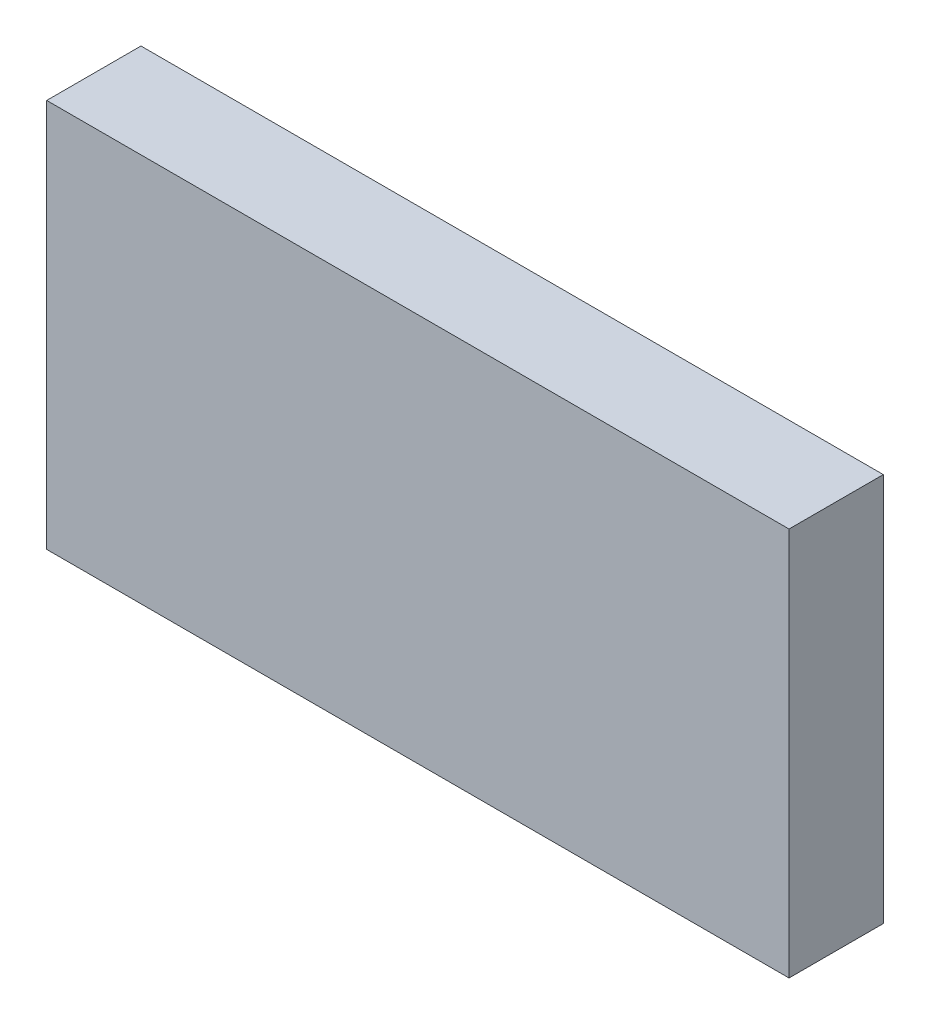
ISO-10303-21;
HEADER;
FILE_DESCRIPTION(('STEP AP214'),'2;1');
FILE_NAME('part.step','',(''),(''),'','','');
FILE_SCHEMA(('AUTOMOTIVE_DESIGN { 1 0 10303 214 1 1 1 1 }'));
ENDSEC;
DATA;
#1=APPLICATION_CONTEXT('core data for automotive mechanical design processes');
#2=APPLICATION_PROTOCOL_DEFINITION('international standard','automotive_design',2000,#1);
#3=PRODUCT_CONTEXT('',#1,'mechanical');
#4=PRODUCT('Part','Part','',(#3));
#5=PRODUCT_RELATED_PRODUCT_CATEGORY('part','',(#4));
#6=PRODUCT_DEFINITION_FORMATION('','',#4);
#7=PRODUCT_DEFINITION_CONTEXT('part definition',#1,'design');
#8=PRODUCT_DEFINITION('design','',#6,#7);
#9=PRODUCT_DEFINITION_SHAPE('','',#8);
#10=(LENGTH_UNIT() NAMED_UNIT(*) SI_UNIT(.MILLI.,.METRE.));
#11=(NAMED_UNIT(*) PLANE_ANGLE_UNIT() SI_UNIT($,.RADIAN.));
#12=(NAMED_UNIT(*) SI_UNIT($,.STERADIAN.) SOLID_ANGLE_UNIT());
#13=UNCERTAINTY_MEASURE_WITH_UNIT(LENGTH_MEASURE(1.E-05),#10,'distance_accuracy_value','');
#14=(GEOMETRIC_REPRESENTATION_CONTEXT(3) GLOBAL_UNCERTAINTY_ASSIGNED_CONTEXT((#13)) GLOBAL_UNIT_ASSIGNED_CONTEXT((#10,
#11,#12)) REPRESENTATION_CONTEXT('',''));
#15=CARTESIAN_POINT('',(0.,0.,0.));
#16=DIRECTION('',(0.,0.,1.));
#17=DIRECTION('',(1.,0.,0.));
#18=AXIS2_PLACEMENT_3D('',#15,#16,#17);
#19=CARTESIAN_POINT('',(-1.57779786361259,-15.619026203913,1.03674101378445E-06));
#20=DIRECTION('',(0.,8.74227339409092E-08,-1.));
#21=DIRECTION('',(-1.,8.74227765734792E-08,0.));
#22=AXIS2_PLACEMENT_3D('',#19,#20,#21);
#23=PLANE('',#22);
#24=DIRECTION('',(1.,-8.74227767111557E-08,0.));
#25=VECTOR('',#24,1.);
#26=CARTESIAN_POINT('',(-1.57779800786017,-17.2690262039129,8.92493502713254E-07));
#27=LINE('',#26,#25);
#28=CARTESIAN_POINT('',(-4.72779800786016,-17.2690259285312,8.92493526999383E-07));
#29=VERTEX_POINT('',#28);
#30=CARTESIAN_POINT('',(1.57220199213981,-17.2690264792947,8.92493478860806E-07));
#31=VERTEX_POINT('',#30);
#32=EDGE_CURVE('E90',#29,#31,#27,.T.);
#33=ORIENTED_EDGE('',*,*,#32,.T.);
#34=DIRECTION('',(8.74227765734795E-08,1.,8.74227339409088E-08));
#35=VECTOR('',#34,1.);
#36=CARTESIAN_POINT('',(1.5722021363874,-15.6190264792947,1.03674098949832E-06));
#37=LINE('',#36,#35);
#38=CARTESIAN_POINT('',(1.57220228063498,-13.9690264792947,1.18098850056952E-06));
#39=VERTEX_POINT('',#38);
#40=EDGE_CURVE('E27',#31,#39,#37,.T.);
#41=ORIENTED_EDGE('',*,*,#40,.T.);
#42=DIRECTION('',(1.,-8.74227767111557E-08,0.));
#43=VECTOR('',#42,1.);
#44=CARTESIAN_POINT('',(-1.57779771936501,-13.969026203913,1.18098852485565E-06));
#45=LINE('',#44,#43);
#46=CARTESIAN_POINT('',(-4.72779771936499,-13.9690259285312,1.1809885487081E-06));
#47=VERTEX_POINT('',#46);
#48=EDGE_CURVE('E78',#47,#39,#45,.T.);
#49=ORIENTED_EDGE('',*,*,#48,.F.);
#50=DIRECTION('',(8.74227765734795E-08,1.,8.74227339409088E-08));
#51=VECTOR('',#50,1.);
#52=CARTESIAN_POINT('',(-4.72779786361258,-15.6190259285313,1.03674103807058E-06));
#53=LINE('',#52,#51);
#54=EDGE_CURVE('E101',#29,#47,#53,.T.);
#55=ORIENTED_EDGE('',*,*,#54,.F.);
#56=EDGE_LOOP('',(#33,#41,#49,#55));
#57=FACE_BOUND('',#56,.T.);
#58=ADVANCED_FACE('F17',(#57),#23,.F.);
#59=CARTESIAN_POINT('',(-1.57779786361259,-15.6190261339748,-0.799998963258982));
#60=DIRECTION('',(0.,8.74227339409092E-08,-1.));
#61=DIRECTION('',(-1.,8.74227765734792E-08,0.));
#62=AXIS2_PLACEMENT_3D('',#59,#60,#61);
#63=PLANE('',#62);
#64=DIRECTION('',(1.,-8.74227767111557E-08,0.));
#65=VECTOR('',#64,1.);
#66=CARTESIAN_POINT('',(-1.57779800786017,-17.2690261339748,-0.799999107506493));
#67=LINE('',#66,#65);
#68=CARTESIAN_POINT('',(-4.72779800786016,-17.2690258585931,-0.799999107506469));
#69=VERTEX_POINT('',#68);
#70=CARTESIAN_POINT('',(1.57220199213981,-17.2690264093566,-0.799999107506517));
#71=VERTEX_POINT('',#70);
#72=EDGE_CURVE('E81',#69,#71,#67,.T.);
#73=ORIENTED_EDGE('',*,*,#72,.F.);
#74=DIRECTION('',(8.74227765734795E-08,1.,8.74227339409088E-08));
#75=VECTOR('',#74,1.);
#76=CARTESIAN_POINT('',(-4.72779786361258,-15.6190258585931,-0.799998963258958));
#77=LINE('',#76,#75);
#78=CARTESIAN_POINT('',(-4.72779771936499,-13.9690258585931,-0.799998819011447));
#79=VERTEX_POINT('',#78);
#80=EDGE_CURVE('E67',#69,#79,#77,.T.);
#81=ORIENTED_EDGE('',*,*,#80,.T.);
#82=DIRECTION('',(1.,-8.74227767111557E-08,0.));
#83=VECTOR('',#82,1.);
#84=CARTESIAN_POINT('',(-1.57779771936501,-13.9690261339748,-0.799998819011471));
#85=LINE('',#84,#83);
#86=CARTESIAN_POINT('',(1.57220228063498,-13.9690264093565,-0.799998819011495));
#87=VERTEX_POINT('',#86);
#88=EDGE_CURVE('E111',#79,#87,#85,.T.);
#89=ORIENTED_EDGE('',*,*,#88,.T.);
#90=DIRECTION('',(8.74227765734795E-08,1.,8.74227339409088E-08));
#91=VECTOR('',#90,1.);
#92=CARTESIAN_POINT('',(1.5722021363874,-15.6190264093566,-0.799998963259006));
#93=LINE('',#92,#91);
#94=EDGE_CURVE('E11',#71,#87,#93,.T.);
#95=ORIENTED_EDGE('',*,*,#94,.F.);
#96=EDGE_LOOP('',(#73,#81,#89,#95));
#97=FACE_BOUND('',#96,.T.);
#98=ADVANCED_FACE('F82',(#97),#63,.T.);
#99=CARTESIAN_POINT('',(1.5722021363874,-15.6190264093566,-0.799998963259006));
#100=DIRECTION('',(1.,-8.74227765734792E-08,0.));
#101=DIRECTION('',(0.,8.74227339409092E-08,-1.));
#102=AXIS2_PLACEMENT_3D('',#99,#100,#101);
#103=PLANE('',#102);
#104=ORIENTED_EDGE('',*,*,#40,.F.);
#105=DIRECTION('',(0.,-8.74227339409092E-08,1.));
#106=VECTOR('',#105,1.);
#107=CARTESIAN_POINT('',(1.57220199213981,-17.2690264093566,-0.799999107506517));
#108=LINE('',#107,#106);
#109=EDGE_CURVE('E86',#71,#31,#108,.T.);
#110=ORIENTED_EDGE('',*,*,#109,.F.);
#111=ORIENTED_EDGE('',*,*,#94,.T.);
#112=DIRECTION('',(0.,-8.74227339409092E-08,1.));
#113=VECTOR('',#112,1.);
#114=CARTESIAN_POINT('',(1.57220228063498,-13.9690264093565,-0.799998819011495));
#115=LINE('',#114,#113);
#116=EDGE_CURVE('E108',#87,#39,#115,.T.);
#117=ORIENTED_EDGE('',*,*,#116,.T.);
#118=EDGE_LOOP('',(#104,#110,#111,#117));
#119=FACE_BOUND('',#118,.T.);
#120=ADVANCED_FACE('F140',(#119),#103,.T.);
#121=CARTESIAN_POINT('',(-1.57779771936501,-13.9690261339748,-0.799998819011471));
#122=DIRECTION('',(-8.7422776711156E-08,-1.,-8.74227339409088E-08));
#123=DIRECTION('',(-1.,8.74227767111557E-08,0.));
#124=AXIS2_PLACEMENT_3D('',#121,#122,#123);
#125=PLANE('',#124);
#126=ORIENTED_EDGE('',*,*,#48,.T.);
#127=ORIENTED_EDGE('',*,*,#116,.F.);
#128=ORIENTED_EDGE('',*,*,#88,.F.);
#129=DIRECTION('',(0.,-8.74227339409092E-08,1.));
#130=VECTOR('',#129,1.);
#131=CARTESIAN_POINT('',(-4.72779771936499,-13.9690258585931,-0.799998819011447));
#132=LINE('',#131,#130);
#133=EDGE_CURVE('E75',#79,#47,#132,.T.);
#134=ORIENTED_EDGE('',*,*,#133,.T.);
#135=EDGE_LOOP('',(#126,#127,#128,#134));
#136=FACE_BOUND('',#135,.T.);
#137=ADVANCED_FACE('F139',(#136),#125,.F.);
#138=CARTESIAN_POINT('',(-4.72779786361258,-15.6190258585931,-0.799998963258958));
#139=DIRECTION('',(1.,-8.74227765734792E-08,0.));
#140=DIRECTION('',(0.,8.74227339409092E-08,-1.));
#141=AXIS2_PLACEMENT_3D('',#138,#139,#140);
#142=PLANE('',#141);
#143=ORIENTED_EDGE('',*,*,#54,.T.);
#144=ORIENTED_EDGE('',*,*,#133,.F.);
#145=ORIENTED_EDGE('',*,*,#80,.F.);
#146=DIRECTION('',(0.,-8.74227339409092E-08,1.));
#147=VECTOR('',#146,1.);
#148=CARTESIAN_POINT('',(-4.72779800786016,-17.2690258585931,-0.799999107506469));
#149=LINE('',#148,#147);
#150=EDGE_CURVE('E72',#69,#29,#149,.T.);
#151=ORIENTED_EDGE('',*,*,#150,.T.);
#152=EDGE_LOOP('',(#143,#144,#145,#151));
#153=FACE_BOUND('',#152,.T.);
#154=ADVANCED_FACE('F70',(#153),#142,.F.);
#155=CARTESIAN_POINT('',(-1.57779800786017,-17.2690261339748,-0.799999107506493));
#156=DIRECTION('',(-8.7422776711156E-08,-1.,-8.74227339409088E-08));
#157=DIRECTION('',(-1.,8.74227767111557E-08,0.));
#158=AXIS2_PLACEMENT_3D('',#155,#156,#157);
#159=PLANE('',#158);
#160=ORIENTED_EDGE('',*,*,#32,.F.);
#161=ORIENTED_EDGE('',*,*,#150,.F.);
#162=ORIENTED_EDGE('',*,*,#72,.T.);
#163=ORIENTED_EDGE('',*,*,#109,.T.);
#164=EDGE_LOOP('',(#160,#161,#162,#163));
#165=FACE_BOUND('',#164,.T.);
#166=ADVANCED_FACE('F88',(#165),#159,.T.);
#167=CLOSED_SHELL('',(#58,#98,#120,#137,#154,#166));
#168=MANIFOLD_SOLID_BREP('B1',#167);
#169=ADVANCED_BREP_SHAPE_REPRESENTATION('',(#18,#168),#14);
#170=SHAPE_DEFINITION_REPRESENTATION(#9,#169);
ENDSEC;
END-ISO-10303-21;
